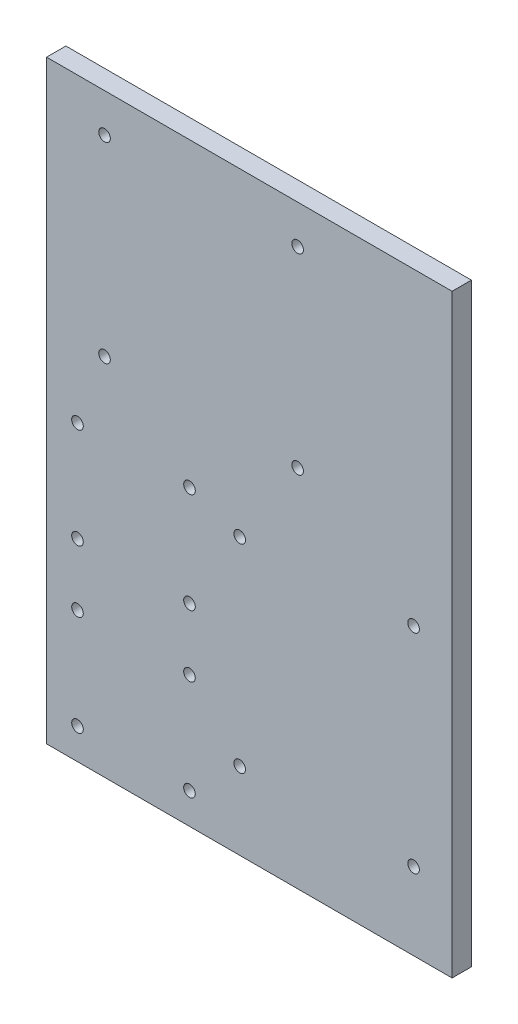
ISO-10303-21;
HEADER;
FILE_DESCRIPTION(('STEP AP214'),'2;1');
FILE_NAME('part.step','',(''),(''),'','','');
FILE_SCHEMA(('AUTOMOTIVE_DESIGN { 1 0 10303 214 1 1 1 1 }'));
ENDSEC;
DATA;
#1=APPLICATION_CONTEXT('core data for automotive mechanical design processes');
#2=APPLICATION_PROTOCOL_DEFINITION('international standard','automotive_design',2000,#1);
#3=PRODUCT_CONTEXT('',#1,'mechanical');
#4=PRODUCT('Part','Part','',(#3));
#5=PRODUCT_RELATED_PRODUCT_CATEGORY('part','',(#4));
#6=PRODUCT_DEFINITION_FORMATION('','',#4);
#7=PRODUCT_DEFINITION_CONTEXT('part definition',#1,'design');
#8=PRODUCT_DEFINITION('design','',#6,#7);
#9=PRODUCT_DEFINITION_SHAPE('','',#8);
#10=(LENGTH_UNIT() NAMED_UNIT(*) SI_UNIT(.MILLI.,.METRE.));
#11=(NAMED_UNIT(*) PLANE_ANGLE_UNIT() SI_UNIT($,.RADIAN.));
#12=(NAMED_UNIT(*) SI_UNIT($,.STERADIAN.) SOLID_ANGLE_UNIT());
#13=UNCERTAINTY_MEASURE_WITH_UNIT(LENGTH_MEASURE(1.E-05),#10,'distance_accuracy_value','');
#14=(GEOMETRIC_REPRESENTATION_CONTEXT(3) GLOBAL_UNCERTAINTY_ASSIGNED_CONTEXT((#13)) GLOBAL_UNIT_ASSIGNED_CONTEXT((#10,
#11,#12)) REPRESENTATION_CONTEXT('',''));
#15=CARTESIAN_POINT('',(0.,0.,0.));
#16=DIRECTION('',(0.,0.,1.));
#17=DIRECTION('',(1.,0.,0.));
#18=AXIS2_PLACEMENT_3D('',#15,#16,#17);
#19=CARTESIAN_POINT('',(-40.,-119.,5.));
#20=DIRECTION('',(0.,1.,0.));
#21=DIRECTION('',(0.,0.,1.));
#22=AXIS2_PLACEMENT_3D('',#19,#20,#21);
#23=PLANE('',#22);
#24=DIRECTION('',(1.,0.,0.));
#25=VECTOR('',#24,1.);
#26=CARTESIAN_POINT('',(-40.,-119.,0.));
#27=LINE('',#26,#25);
#28=CARTESIAN_POINT('',(-40.,-119.,0.));
#29=VERTEX_POINT('',#28);
#30=CARTESIAN_POINT('',(65.,-119.,0.));
#31=VERTEX_POINT('',#30);
#32=EDGE_CURVE('E99',#29,#31,#27,.T.);
#33=ORIENTED_EDGE('',*,*,#32,.T.);
#34=DIRECTION('',(0.,0.,-1.));
#35=VECTOR('',#34,1.);
#36=CARTESIAN_POINT('',(65.,-119.,5.));
#37=LINE('',#36,#35);
#38=CARTESIAN_POINT('',(65.,-119.,5.));
#39=VERTEX_POINT('',#38);
#40=EDGE_CURVE('E11',#39,#31,#37,.T.);
#41=ORIENTED_EDGE('',*,*,#40,.F.);
#42=DIRECTION('',(1.,0.,0.));
#43=VECTOR('',#42,1.);
#44=CARTESIAN_POINT('',(-40.,-119.,5.));
#45=LINE('',#44,#43);
#46=CARTESIAN_POINT('',(-40.,-119.,5.));
#47=VERTEX_POINT('',#46);
#48=EDGE_CURVE('E76',#47,#39,#45,.T.);
#49=ORIENTED_EDGE('',*,*,#48,.F.);
#50=DIRECTION('',(0.,0.,-1.));
#51=VECTOR('',#50,1.);
#52=CARTESIAN_POINT('',(-40.,-119.,5.));
#53=LINE('',#52,#51);
#54=EDGE_CURVE('E95',#47,#29,#53,.T.);
#55=ORIENTED_EDGE('',*,*,#54,.T.);
#56=EDGE_LOOP('',(#33,#41,#49,#55));
#57=FACE_BOUND('',#56,.T.);
#58=ADVANCED_FACE('F37',(#57),#23,.F.);
#59=CARTESIAN_POINT('',(65.,35.,5.));
#60=DIRECTION('',(1.,0.,0.));
#61=DIRECTION('',(0.,0.,-1.));
#62=AXIS2_PLACEMENT_3D('',#59,#60,#61);
#63=PLANE('',#62);
#64=DIRECTION('',(0.,-1.,0.));
#65=VECTOR('',#64,1.);
#66=CARTESIAN_POINT('',(65.,35.,0.));
#67=LINE('',#66,#65);
#68=CARTESIAN_POINT('',(65.,35.,0.));
#69=VERTEX_POINT('',#68);
#70=EDGE_CURVE('E85',#69,#31,#67,.T.);
#71=ORIENTED_EDGE('',*,*,#70,.F.);
#72=DIRECTION('',(0.,0.,-1.));
#73=VECTOR('',#72,1.);
#74=CARTESIAN_POINT('',(65.,35.,5.));
#75=LINE('',#74,#73);
#76=CARTESIAN_POINT('',(65.,35.,5.));
#77=VERTEX_POINT('',#76);
#78=EDGE_CURVE('E45',#77,#69,#75,.T.);
#79=ORIENTED_EDGE('',*,*,#78,.F.);
#80=DIRECTION('',(0.,-1.,0.));
#81=VECTOR('',#80,1.);
#82=CARTESIAN_POINT('',(65.,35.,5.));
#83=LINE('',#82,#81);
#84=EDGE_CURVE('E83',#77,#39,#83,.T.);
#85=ORIENTED_EDGE('',*,*,#84,.T.);
#86=ORIENTED_EDGE('',*,*,#40,.T.);
#87=EDGE_LOOP('',(#71,#79,#85,#86));
#88=FACE_BOUND('',#87,.T.);
#89=ADVANCED_FACE('F82',(#88),#63,.T.);
#90=CARTESIAN_POINT('',(-40.,35.,5.));
#91=DIRECTION('',(0.,1.,0.));
#92=DIRECTION('',(0.,0.,1.));
#93=AXIS2_PLACEMENT_3D('',#90,#91,#92);
#94=PLANE('',#93);
#95=DIRECTION('',(1.,0.,0.));
#96=VECTOR('',#95,1.);
#97=CARTESIAN_POINT('',(-40.,35.,0.));
#98=LINE('',#97,#96);
#99=CARTESIAN_POINT('',(-40.,35.,0.));
#100=VERTEX_POINT('',#99);
#101=EDGE_CURVE('E104',#100,#69,#98,.T.);
#102=ORIENTED_EDGE('',*,*,#101,.F.);
#103=DIRECTION('',(0.,0.,-1.));
#104=VECTOR('',#103,1.);
#105=CARTESIAN_POINT('',(-40.,35.,5.));
#106=LINE('',#105,#104);
#107=CARTESIAN_POINT('',(-40.,35.,5.));
#108=VERTEX_POINT('',#107);
#109=EDGE_CURVE('E68',#108,#100,#106,.T.);
#110=ORIENTED_EDGE('',*,*,#109,.F.);
#111=DIRECTION('',(1.,0.,0.));
#112=VECTOR('',#111,1.);
#113=CARTESIAN_POINT('',(-40.,35.,5.));
#114=LINE('',#113,#112);
#115=EDGE_CURVE('E91',#108,#77,#114,.T.);
#116=ORIENTED_EDGE('',*,*,#115,.T.);
#117=ORIENTED_EDGE('',*,*,#78,.T.);
#118=EDGE_LOOP('',(#102,#110,#116,#117));
#119=FACE_BOUND('',#118,.T.);
#120=ADVANCED_FACE('F93',(#119),#94,.T.);
#121=CARTESIAN_POINT('',(-40.,35.,5.));
#122=DIRECTION('',(1.,0.,0.));
#123=DIRECTION('',(0.,1.,0.));
#124=AXIS2_PLACEMENT_3D('',#121,#122,#123);
#125=PLANE('',#124);
#126=DIRECTION('',(0.,-1.,0.));
#127=VECTOR('',#126,1.);
#128=CARTESIAN_POINT('',(-40.,35.,0.));
#129=LINE('',#128,#127);
#130=EDGE_CURVE('E71',#100,#29,#129,.T.);
#131=ORIENTED_EDGE('',*,*,#130,.T.);
#132=ORIENTED_EDGE('',*,*,#54,.F.);
#133=DIRECTION('',(0.,-1.,0.));
#134=VECTOR('',#133,1.);
#135=CARTESIAN_POINT('',(-40.,35.,5.));
#136=LINE('',#135,#134);
#137=EDGE_CURVE('E53',#108,#47,#136,.T.);
#138=ORIENTED_EDGE('',*,*,#137,.F.);
#139=ORIENTED_EDGE('',*,*,#109,.T.);
#140=EDGE_LOOP('',(#131,#132,#138,#139));
#141=FACE_BOUND('',#140,.T.);
#142=ADVANCED_FACE('F123',(#141),#125,.F.);
#143=CARTESIAN_POINT('',(0.,0.,5.));
#144=DIRECTION('',(0.,0.,-1.));
#145=DIRECTION('',(-1.,0.,0.));
#146=AXIS2_PLACEMENT_3D('',#143,#144,#145);
#147=PLANE('',#146);
#148=CARTESIAN_POINT('',(9.99999999999999,-47.56,5.));
#149=DIRECTION('',(0.,0.,-1.));
#150=DIRECTION('',(-1.,0.,0.));
#151=AXIS2_PLACEMENT_3D('',#148,#149,#150);
#152=CIRCLE('',#151,1.5);
#153=CARTESIAN_POINT('',(8.49999999999999,-47.56,5.));
#154=VERTEX_POINT('',#153);
#155=EDGE_CURVE('E349',#154,#154,#152,.T.);
#156=ORIENTED_EDGE('',*,*,#155,.T.);
#157=EDGE_LOOP('',(#156));
#158=FACE_BOUND('',#157,.T.);
#159=CARTESIAN_POINT('',(9.99999999999999,-99.,5.));
#160=DIRECTION('',(0.,0.,-1.));
#161=DIRECTION('',(-1.,0.,0.));
#162=AXIS2_PLACEMENT_3D('',#159,#160,#161);
#163=CIRCLE('',#162,1.5);
#164=CARTESIAN_POINT('',(8.49999999999998,-99.,5.));
#165=VERTEX_POINT('',#164);
#166=EDGE_CURVE('E355',#165,#165,#163,.T.);
#167=ORIENTED_EDGE('',*,*,#166,.T.);
#168=EDGE_LOOP('',(#167));
#169=FACE_BOUND('',#168,.T.);
#170=CARTESIAN_POINT('',(55.0184017930446,-99.,5.));
#171=DIRECTION('',(0.,0.,-1.));
#172=DIRECTION('',(-1.,0.,0.));
#173=AXIS2_PLACEMENT_3D('',#170,#171,#172);
#174=CIRCLE('',#173,1.5);
#175=CARTESIAN_POINT('',(53.5184017930446,-99.,5.));
#176=VERTEX_POINT('',#175);
#177=EDGE_CURVE('E343',#176,#176,#174,.T.);
#178=ORIENTED_EDGE('',*,*,#177,.T.);
#179=EDGE_LOOP('',(#178));
#180=FACE_BOUND('',#179,.T.);
#181=CARTESIAN_POINT('',(55.0184017930446,-45.02,5.));
#182=DIRECTION('',(0.,0.,-1.));
#183=DIRECTION('',(-1.,0.,0.));
#184=AXIS2_PLACEMENT_3D('',#181,#182,#183);
#185=CIRCLE('',#184,1.5);
#186=CARTESIAN_POINT('',(53.5184017930446,-45.02,5.));
#187=VERTEX_POINT('',#186);
#188=EDGE_CURVE('E326',#187,#187,#185,.T.);
#189=ORIENTED_EDGE('',*,*,#188,.T.);
#190=EDGE_LOOP('',(#189));
#191=FACE_BOUND('',#190,.T.);
#192=CARTESIAN_POINT('',(25.,-24.6066772895717,5.));
#193=DIRECTION('',(0.,0.,-1.));
#194=DIRECTION('',(-1.,0.,0.));
#195=AXIS2_PLACEMENT_3D('',#192,#193,#194);
#196=CIRCLE('',#195,1.5);
#197=CARTESIAN_POINT('',(23.5,-24.6066772895717,5.));
#198=VERTEX_POINT('',#197);
#199=EDGE_CURVE('E325',#198,#198,#196,.T.);
#200=ORIENTED_EDGE('',*,*,#199,.T.);
#201=EDGE_LOOP('',(#200));
#202=FACE_BOUND('',#201,.T.);
#203=CARTESIAN_POINT('',(-25.,-24.6066772895717,5.));
#204=DIRECTION('',(0.,0.,-1.));
#205=DIRECTION('',(-1.,0.,0.));
#206=AXIS2_PLACEMENT_3D('',#203,#204,#205);
#207=CIRCLE('',#206,1.5);
#208=CARTESIAN_POINT('',(-26.5,-24.6066772895717,5.));
#209=VERTEX_POINT('',#208);
#210=EDGE_CURVE('E332',#209,#209,#207,.T.);
#211=ORIENTED_EDGE('',*,*,#210,.T.);
#212=EDGE_LOOP('',(#211));
#213=FACE_BOUND('',#212,.T.);
#214=CARTESIAN_POINT('',(-25.,25.,5.));
#215=DIRECTION('',(0.,0.,-1.));
#216=DIRECTION('',(-1.,0.,0.));
#217=AXIS2_PLACEMENT_3D('',#214,#215,#216);
#218=CIRCLE('',#217,1.5);
#219=CARTESIAN_POINT('',(-26.5,25.,5.));
#220=VERTEX_POINT('',#219);
#221=EDGE_CURVE('E319',#220,#220,#218,.T.);
#222=ORIENTED_EDGE('',*,*,#221,.T.);
#223=EDGE_LOOP('',(#222));
#224=FACE_BOUND('',#223,.T.);
#225=CARTESIAN_POINT('',(25.,25.,5.));
#226=DIRECTION('',(0.,0.,-1.));
#227=DIRECTION('',(-1.,0.,0.));
#228=AXIS2_PLACEMENT_3D('',#225,#226,#227);
#229=CIRCLE('',#228,1.5);
#230=CARTESIAN_POINT('',(23.5,25.,5.));
#231=VERTEX_POINT('',#230);
#232=EDGE_CURVE('E311',#231,#231,#229,.T.);
#233=ORIENTED_EDGE('',*,*,#232,.T.);
#234=EDGE_LOOP('',(#233));
#235=FACE_BOUND('',#234,.T.);
#236=CARTESIAN_POINT('',(-3.00000000000002,-43.,5.));
#237=DIRECTION('',(0.,0.,-1.));
#238=DIRECTION('',(-1.,0.,0.));
#239=AXIS2_PLACEMENT_3D('',#236,#237,#238);
#240=CIRCLE('',#239,1.5);
#241=CARTESIAN_POINT('',(-4.50000000000002,-43.,5.));
#242=VERTEX_POINT('',#241);
#243=EDGE_CURVE('E102',#242,#242,#240,.T.);
#244=ORIENTED_EDGE('',*,*,#243,.T.);
#245=EDGE_LOOP('',(#244));
#246=FACE_BOUND('',#245,.T.);
#247=CARTESIAN_POINT('',(-3.00000000000002,-69.,5.));
#248=DIRECTION('',(0.,0.,-1.));
#249=DIRECTION('',(-1.,0.,0.));
#250=AXIS2_PLACEMENT_3D('',#247,#248,#249);
#251=CIRCLE('',#250,1.5);
#252=CARTESIAN_POINT('',(-4.50000000000002,-69.,5.));
#253=VERTEX_POINT('',#252);
#254=EDGE_CURVE('E259',#253,#253,#251,.T.);
#255=ORIENTED_EDGE('',*,*,#254,.T.);
#256=EDGE_LOOP('',(#255));
#257=FACE_BOUND('',#256,.T.);
#258=CARTESIAN_POINT('',(-32.,-85.,5.));
#259=DIRECTION('',(0.,0.,-1.));
#260=DIRECTION('',(-1.,0.,0.));
#261=AXIS2_PLACEMENT_3D('',#258,#259,#260);
#262=CIRCLE('',#261,1.5);
#263=CARTESIAN_POINT('',(-33.5,-85.,5.));
#264=VERTEX_POINT('',#263);
#265=EDGE_CURVE('E255',#264,#264,#262,.T.);
#266=ORIENTED_EDGE('',*,*,#265,.T.);
#267=EDGE_LOOP('',(#266));
#268=FACE_BOUND('',#267,.T.);
#269=CARTESIAN_POINT('',(-32.,-111.,5.));
#270=DIRECTION('',(0.,0.,-1.));
#271=DIRECTION('',(-1.,0.,0.));
#272=AXIS2_PLACEMENT_3D('',#269,#270,#271);
#273=CIRCLE('',#272,1.5);
#274=CARTESIAN_POINT('',(-33.5,-111.,5.));
#275=VERTEX_POINT('',#274);
#276=EDGE_CURVE('E253',#275,#275,#273,.T.);
#277=ORIENTED_EDGE('',*,*,#276,.T.);
#278=EDGE_LOOP('',(#277));
#279=FACE_BOUND('',#278,.T.);
#280=CARTESIAN_POINT('',(-3.00000000000005,-111.,5.));
#281=DIRECTION('',(0.,0.,-1.));
#282=DIRECTION('',(-1.,0.,0.));
#283=AXIS2_PLACEMENT_3D('',#280,#281,#282);
#284=CIRCLE('',#283,1.5);
#285=CARTESIAN_POINT('',(-4.50000000000005,-111.,5.));
#286=VERTEX_POINT('',#285);
#287=EDGE_CURVE('E256',#286,#286,#284,.T.);
#288=ORIENTED_EDGE('',*,*,#287,.T.);
#289=EDGE_LOOP('',(#288));
#290=FACE_BOUND('',#289,.T.);
#291=CARTESIAN_POINT('',(-3.00000000000005,-85.,5.));
#292=DIRECTION('',(0.,0.,-1.));
#293=DIRECTION('',(-1.,0.,0.));
#294=AXIS2_PLACEMENT_3D('',#291,#292,#293);
#295=CIRCLE('',#294,1.5);
#296=CARTESIAN_POINT('',(-4.50000000000005,-85.,5.));
#297=VERTEX_POINT('',#296);
#298=EDGE_CURVE('E262',#297,#297,#295,.T.);
#299=ORIENTED_EDGE('',*,*,#298,.T.);
#300=EDGE_LOOP('',(#299));
#301=FACE_BOUND('',#300,.T.);
#302=CARTESIAN_POINT('',(-32.,-69.,5.));
#303=DIRECTION('',(0.,0.,-1.));
#304=DIRECTION('',(-1.,0.,0.));
#305=AXIS2_PLACEMENT_3D('',#302,#303,#304);
#306=CIRCLE('',#305,1.5);
#307=CARTESIAN_POINT('',(-33.5,-69.,5.));
#308=VERTEX_POINT('',#307);
#309=EDGE_CURVE('E285',#308,#308,#306,.T.);
#310=ORIENTED_EDGE('',*,*,#309,.T.);
#311=EDGE_LOOP('',(#310));
#312=FACE_BOUND('',#311,.T.);
#313=CARTESIAN_POINT('',(-32.,-43.,5.));
#314=DIRECTION('',(0.,0.,-1.));
#315=DIRECTION('',(-1.,0.,0.));
#316=AXIS2_PLACEMENT_3D('',#313,#314,#315);
#317=CIRCLE('',#316,1.5);
#318=CARTESIAN_POINT('',(-33.5,-43.,5.));
#319=VERTEX_POINT('',#318);
#320=EDGE_CURVE('E288',#319,#319,#317,.T.);
#321=ORIENTED_EDGE('',*,*,#320,.T.);
#322=EDGE_LOOP('',(#321));
#323=FACE_BOUND('',#322,.T.);
#324=ORIENTED_EDGE('',*,*,#48,.T.);
#325=ORIENTED_EDGE('',*,*,#84,.F.);
#326=ORIENTED_EDGE('',*,*,#115,.F.);
#327=ORIENTED_EDGE('',*,*,#137,.T.);
#328=EDGE_LOOP('',(#324,#325,#326,#327));
#329=FACE_BOUND('',#328,.T.);
#330=ADVANCED_FACE('F90',(#158,#169,#180,#191,#202,#213,#224,#235,#246,#257,#268,#279,#290,#301,
#312,#323,#329),#147,.F.);
#331=CARTESIAN_POINT('',(0.,0.,0.));
#332=DIRECTION('',(0.,0.,-1.));
#333=DIRECTION('',(-1.,0.,0.));
#334=AXIS2_PLACEMENT_3D('',#331,#332,#333);
#335=PLANE('',#334);
#336=CARTESIAN_POINT('',(9.99999999999999,-47.56,0.));
#337=DIRECTION('',(0.,0.,-1.));
#338=DIRECTION('',(-1.,0.,0.));
#339=AXIS2_PLACEMENT_3D('',#336,#337,#338);
#340=CIRCLE('',#339,1.5);
#341=CARTESIAN_POINT('',(8.49999999999999,-47.56,0.));
#342=VERTEX_POINT('',#341);
#343=EDGE_CURVE('E346',#342,#342,#340,.T.);
#344=ORIENTED_EDGE('',*,*,#343,.F.);
#345=EDGE_LOOP('',(#344));
#346=FACE_BOUND('',#345,.T.);
#347=CARTESIAN_POINT('',(9.99999999999999,-99.,0.));
#348=DIRECTION('',(0.,0.,-1.));
#349=DIRECTION('',(-1.,0.,0.));
#350=AXIS2_PLACEMENT_3D('',#347,#348,#349);
#351=CIRCLE('',#350,1.5);
#352=CARTESIAN_POINT('',(8.49999999999998,-99.,0.));
#353=VERTEX_POINT('',#352);
#354=EDGE_CURVE('E352',#353,#353,#351,.T.);
#355=ORIENTED_EDGE('',*,*,#354,.F.);
#356=EDGE_LOOP('',(#355));
#357=FACE_BOUND('',#356,.T.);
#358=CARTESIAN_POINT('',(55.0184017930446,-99.,0.));
#359=DIRECTION('',(0.,0.,-1.));
#360=DIRECTION('',(-1.,0.,0.));
#361=AXIS2_PLACEMENT_3D('',#358,#359,#360);
#362=CIRCLE('',#361,1.5);
#363=CARTESIAN_POINT('',(53.5184017930446,-99.,0.));
#364=VERTEX_POINT('',#363);
#365=EDGE_CURVE('E358',#364,#364,#362,.T.);
#366=ORIENTED_EDGE('',*,*,#365,.F.);
#367=EDGE_LOOP('',(#366));
#368=FACE_BOUND('',#367,.T.);
#369=CARTESIAN_POINT('',(55.0184017930446,-45.02,0.));
#370=DIRECTION('',(0.,0.,-1.));
#371=DIRECTION('',(-1.,0.,0.));
#372=AXIS2_PLACEMENT_3D('',#369,#370,#371);
#373=CIRCLE('',#372,1.5);
#374=CARTESIAN_POINT('',(53.5184017930446,-45.02,0.));
#375=VERTEX_POINT('',#374);
#376=EDGE_CURVE('E340',#375,#375,#373,.T.);
#377=ORIENTED_EDGE('',*,*,#376,.F.);
#378=EDGE_LOOP('',(#377));
#379=FACE_BOUND('',#378,.T.);
#380=CARTESIAN_POINT('',(25.,-24.6066772895717,0.));
#381=DIRECTION('',(0.,0.,-1.));
#382=DIRECTION('',(-1.,0.,0.));
#383=AXIS2_PLACEMENT_3D('',#380,#381,#382);
#384=CIRCLE('',#383,1.5);
#385=CARTESIAN_POINT('',(23.5,-24.6066772895717,0.));
#386=VERTEX_POINT('',#385);
#387=EDGE_CURVE('E322',#386,#386,#384,.T.);
#388=ORIENTED_EDGE('',*,*,#387,.F.);
#389=EDGE_LOOP('',(#388));
#390=FACE_BOUND('',#389,.T.);
#391=CARTESIAN_POINT('',(-25.,-24.6066772895717,0.));
#392=DIRECTION('',(0.,0.,-1.));
#393=DIRECTION('',(-1.,0.,0.));
#394=AXIS2_PLACEMENT_3D('',#391,#392,#393);
#395=CIRCLE('',#394,1.5);
#396=CARTESIAN_POINT('',(-26.5,-24.6066772895717,0.));
#397=VERTEX_POINT('',#396);
#398=EDGE_CURVE('E329',#397,#397,#395,.T.);
#399=ORIENTED_EDGE('',*,*,#398,.F.);
#400=EDGE_LOOP('',(#399));
#401=FACE_BOUND('',#400,.T.);
#402=CARTESIAN_POINT('',(-25.,25.,0.));
#403=DIRECTION('',(0.,0.,-1.));
#404=DIRECTION('',(-1.,0.,0.));
#405=AXIS2_PLACEMENT_3D('',#402,#403,#404);
#406=CIRCLE('',#405,1.5);
#407=CARTESIAN_POINT('',(-26.5,25.,0.));
#408=VERTEX_POINT('',#407);
#409=EDGE_CURVE('E335',#408,#408,#406,.T.);
#410=ORIENTED_EDGE('',*,*,#409,.F.);
#411=EDGE_LOOP('',(#410));
#412=FACE_BOUND('',#411,.T.);
#413=CARTESIAN_POINT('',(25.,25.,0.));
#414=DIRECTION('',(0.,0.,-1.));
#415=DIRECTION('',(-1.,0.,0.));
#416=AXIS2_PLACEMENT_3D('',#413,#414,#415);
#417=CIRCLE('',#416,1.5);
#418=CARTESIAN_POINT('',(23.5,25.,0.));
#419=VERTEX_POINT('',#418);
#420=EDGE_CURVE('E316',#419,#419,#417,.T.);
#421=ORIENTED_EDGE('',*,*,#420,.F.);
#422=EDGE_LOOP('',(#421));
#423=FACE_BOUND('',#422,.T.);
#424=CARTESIAN_POINT('',(-3.00000000000002,-43.,0.));
#425=DIRECTION('',(0.,0.,-1.));
#426=DIRECTION('',(-1.,0.,0.));
#427=AXIS2_PLACEMENT_3D('',#424,#425,#426);
#428=CIRCLE('',#427,1.5);
#429=CARTESIAN_POINT('',(-4.50000000000002,-43.,0.));
#430=VERTEX_POINT('',#429);
#431=EDGE_CURVE('E294',#430,#430,#428,.T.);
#432=ORIENTED_EDGE('',*,*,#431,.F.);
#433=EDGE_LOOP('',(#432));
#434=FACE_BOUND('',#433,.T.);
#435=CARTESIAN_POINT('',(-3.00000000000002,-69.,0.));
#436=DIRECTION('',(0.,0.,-1.));
#437=DIRECTION('',(-1.,0.,0.));
#438=AXIS2_PLACEMENT_3D('',#435,#436,#437);
#439=CIRCLE('',#438,1.5);
#440=CARTESIAN_POINT('',(-4.50000000000002,-69.,0.));
#441=VERTEX_POINT('',#440);
#442=EDGE_CURVE('E302',#441,#441,#439,.T.);
#443=ORIENTED_EDGE('',*,*,#442,.F.);
#444=EDGE_LOOP('',(#443));
#445=FACE_BOUND('',#444,.T.);
#446=CARTESIAN_POINT('',(-32.,-85.,0.));
#447=DIRECTION('',(0.,0.,-1.));
#448=DIRECTION('',(-1.,0.,0.));
#449=AXIS2_PLACEMENT_3D('',#446,#447,#448);
#450=CIRCLE('',#449,1.5);
#451=CARTESIAN_POINT('',(-33.5,-85.,0.));
#452=VERTEX_POINT('',#451);
#453=EDGE_CURVE('E298',#452,#452,#450,.T.);
#454=ORIENTED_EDGE('',*,*,#453,.F.);
#455=EDGE_LOOP('',(#454));
#456=FACE_BOUND('',#455,.T.);
#457=CARTESIAN_POINT('',(-32.,-111.,0.));
#458=DIRECTION('',(0.,0.,-1.));
#459=DIRECTION('',(-1.,0.,0.));
#460=AXIS2_PLACEMENT_3D('',#457,#458,#459);
#461=CIRCLE('',#460,1.5);
#462=CARTESIAN_POINT('',(-33.5,-111.,0.));
#463=VERTEX_POINT('',#462);
#464=EDGE_CURVE('E250',#463,#463,#461,.T.);
#465=ORIENTED_EDGE('',*,*,#464,.F.);
#466=EDGE_LOOP('',(#465));
#467=FACE_BOUND('',#466,.T.);
#468=CARTESIAN_POINT('',(-3.00000000000005,-111.,0.));
#469=DIRECTION('',(0.,0.,-1.));
#470=DIRECTION('',(-1.,0.,0.));
#471=AXIS2_PLACEMENT_3D('',#468,#469,#470);
#472=CIRCLE('',#471,1.5);
#473=CARTESIAN_POINT('',(-4.50000000000005,-111.,0.));
#474=VERTEX_POINT('',#473);
#475=EDGE_CURVE('E299',#474,#474,#472,.T.);
#476=ORIENTED_EDGE('',*,*,#475,.F.);
#477=EDGE_LOOP('',(#476));
#478=FACE_BOUND('',#477,.T.);
#479=CARTESIAN_POINT('',(-3.00000000000005,-85.,0.));
#480=DIRECTION('',(0.,0.,-1.));
#481=DIRECTION('',(-1.,0.,0.));
#482=AXIS2_PLACEMENT_3D('',#479,#480,#481);
#483=CIRCLE('',#482,1.5);
#484=CARTESIAN_POINT('',(-4.50000000000005,-85.,0.));
#485=VERTEX_POINT('',#484);
#486=EDGE_CURVE('E310',#485,#485,#483,.T.);
#487=ORIENTED_EDGE('',*,*,#486,.F.);
#488=EDGE_LOOP('',(#487));
#489=FACE_BOUND('',#488,.T.);
#490=CARTESIAN_POINT('',(-32.,-69.,0.));
#491=DIRECTION('',(0.,0.,-1.));
#492=DIRECTION('',(-1.,0.,0.));
#493=AXIS2_PLACEMENT_3D('',#490,#491,#492);
#494=CIRCLE('',#493,1.5);
#495=CARTESIAN_POINT('',(-33.5,-69.,0.));
#496=VERTEX_POINT('',#495);
#497=EDGE_CURVE('E307',#496,#496,#494,.T.);
#498=ORIENTED_EDGE('',*,*,#497,.F.);
#499=EDGE_LOOP('',(#498));
#500=FACE_BOUND('',#499,.T.);
#501=CARTESIAN_POINT('',(-32.,-43.,0.));
#502=DIRECTION('',(0.,0.,-1.));
#503=DIRECTION('',(-1.,0.,0.));
#504=AXIS2_PLACEMENT_3D('',#501,#502,#503);
#505=CIRCLE('',#504,1.5);
#506=CARTESIAN_POINT('',(-33.5,-43.,0.));
#507=VERTEX_POINT('',#506);
#508=EDGE_CURVE('E290',#507,#507,#505,.T.);
#509=ORIENTED_EDGE('',*,*,#508,.F.);
#510=EDGE_LOOP('',(#509));
#511=FACE_BOUND('',#510,.T.);
#512=ORIENTED_EDGE('',*,*,#32,.F.);
#513=ORIENTED_EDGE('',*,*,#130,.F.);
#514=ORIENTED_EDGE('',*,*,#101,.T.);
#515=ORIENTED_EDGE('',*,*,#70,.T.);
#516=EDGE_LOOP('',(#512,#513,#514,#515));
#517=FACE_BOUND('',#516,.T.);
#518=ADVANCED_FACE('F111',(#346,#357,#368,#379,#390,#401,#412,#423,#434,#445,#456,#467,#478,
#489,#500,#511,#517),#335,.T.);
#519=CARTESIAN_POINT('',(-32.,-43.,10.));
#520=DIRECTION('',(0.,0.,-1.));
#521=DIRECTION('',(-1.,0.,0.));
#522=AXIS2_PLACEMENT_3D('',#519,#520,#521);
#523=CYLINDRICAL_SURFACE('',#522,1.5);
#524=ORIENTED_EDGE('',*,*,#508,.T.);
#525=EDGE_LOOP('',(#524));
#526=FACE_BOUND('',#525,.T.);
#527=ORIENTED_EDGE('',*,*,#320,.F.);
#528=EDGE_LOOP('',(#527));
#529=FACE_BOUND('',#528,.T.);
#530=ADVANCED_FACE('F113',(#526,#529),#523,.F.);
#531=CARTESIAN_POINT('',(-32.,-69.,10.));
#532=DIRECTION('',(0.,0.,-1.));
#533=DIRECTION('',(-1.,0.,0.));
#534=AXIS2_PLACEMENT_3D('',#531,#532,#533);
#535=CYLINDRICAL_SURFACE('',#534,1.5);
#536=ORIENTED_EDGE('',*,*,#497,.T.);
#537=EDGE_LOOP('',(#536));
#538=FACE_BOUND('',#537,.T.);
#539=ORIENTED_EDGE('',*,*,#309,.F.);
#540=EDGE_LOOP('',(#539));
#541=FACE_BOUND('',#540,.T.);
#542=ADVANCED_FACE('F120',(#538,#541),#535,.F.);
#543=CARTESIAN_POINT('',(-3.00000000000005,-85.,10.));
#544=DIRECTION('',(0.,0.,-1.));
#545=DIRECTION('',(-1.,0.,0.));
#546=AXIS2_PLACEMENT_3D('',#543,#544,#545);
#547=CYLINDRICAL_SURFACE('',#546,1.5);
#548=ORIENTED_EDGE('',*,*,#486,.T.);
#549=EDGE_LOOP('',(#548));
#550=FACE_BOUND('',#549,.T.);
#551=ORIENTED_EDGE('',*,*,#298,.F.);
#552=EDGE_LOOP('',(#551));
#553=FACE_BOUND('',#552,.T.);
#554=ADVANCED_FACE('F224',(#550,#553),#547,.F.);
#555=CARTESIAN_POINT('',(-3.00000000000005,-111.,10.));
#556=DIRECTION('',(0.,0.,-1.));
#557=DIRECTION('',(-1.,0.,0.));
#558=AXIS2_PLACEMENT_3D('',#555,#556,#557);
#559=CYLINDRICAL_SURFACE('',#558,1.5);
#560=ORIENTED_EDGE('',*,*,#475,.T.);
#561=EDGE_LOOP('',(#560));
#562=FACE_BOUND('',#561,.T.);
#563=ORIENTED_EDGE('',*,*,#287,.F.);
#564=EDGE_LOOP('',(#563));
#565=FACE_BOUND('',#564,.T.);
#566=ADVANCED_FACE('F220',(#562,#565),#559,.F.);
#567=CARTESIAN_POINT('',(-32.,-111.,10.));
#568=DIRECTION('',(0.,0.,-1.));
#569=DIRECTION('',(-1.,0.,0.));
#570=AXIS2_PLACEMENT_3D('',#567,#568,#569);
#571=CYLINDRICAL_SURFACE('',#570,1.5);
#572=ORIENTED_EDGE('',*,*,#464,.T.);
#573=EDGE_LOOP('',(#572));
#574=FACE_BOUND('',#573,.T.);
#575=ORIENTED_EDGE('',*,*,#276,.F.);
#576=EDGE_LOOP('',(#575));
#577=FACE_BOUND('',#576,.T.);
#578=ADVANCED_FACE('F223',(#574,#577),#571,.F.);
#579=CARTESIAN_POINT('',(-32.,-85.,10.));
#580=DIRECTION('',(0.,0.,-1.));
#581=DIRECTION('',(-1.,0.,0.));
#582=AXIS2_PLACEMENT_3D('',#579,#580,#581);
#583=CYLINDRICAL_SURFACE('',#582,1.5);
#584=ORIENTED_EDGE('',*,*,#453,.T.);
#585=EDGE_LOOP('',(#584));
#586=FACE_BOUND('',#585,.T.);
#587=ORIENTED_EDGE('',*,*,#265,.F.);
#588=EDGE_LOOP('',(#587));
#589=FACE_BOUND('',#588,.T.);
#590=ADVANCED_FACE('F238',(#586,#589),#583,.F.);
#591=CARTESIAN_POINT('',(-3.00000000000002,-69.,10.));
#592=DIRECTION('',(0.,0.,-1.));
#593=DIRECTION('',(-1.,0.,0.));
#594=AXIS2_PLACEMENT_3D('',#591,#592,#593);
#595=CYLINDRICAL_SURFACE('',#594,1.5);
#596=ORIENTED_EDGE('',*,*,#442,.T.);
#597=EDGE_LOOP('',(#596));
#598=FACE_BOUND('',#597,.T.);
#599=ORIENTED_EDGE('',*,*,#254,.F.);
#600=EDGE_LOOP('',(#599));
#601=FACE_BOUND('',#600,.T.);
#602=ADVANCED_FACE('F234',(#598,#601),#595,.F.);
#603=CARTESIAN_POINT('',(-3.00000000000002,-43.,10.));
#604=DIRECTION('',(0.,0.,-1.));
#605=DIRECTION('',(-1.,0.,0.));
#606=AXIS2_PLACEMENT_3D('',#603,#604,#605);
#607=CYLINDRICAL_SURFACE('',#606,1.5);
#608=ORIENTED_EDGE('',*,*,#431,.T.);
#609=EDGE_LOOP('',(#608));
#610=FACE_BOUND('',#609,.T.);
#611=ORIENTED_EDGE('',*,*,#243,.F.);
#612=EDGE_LOOP('',(#611));
#613=FACE_BOUND('',#612,.T.);
#614=ADVANCED_FACE('F218',(#610,#613),#607,.F.);
#615=CARTESIAN_POINT('',(25.,25.,5.));
#616=DIRECTION('',(0.,0.,-1.));
#617=DIRECTION('',(-1.,0.,0.));
#618=AXIS2_PLACEMENT_3D('',#615,#616,#617);
#619=CYLINDRICAL_SURFACE('',#618,1.5);
#620=ORIENTED_EDGE('',*,*,#232,.F.);
#621=EDGE_LOOP('',(#620));
#622=FACE_BOUND('',#621,.T.);
#623=ORIENTED_EDGE('',*,*,#420,.T.);
#624=EDGE_LOOP('',(#623));
#625=FACE_BOUND('',#624,.T.);
#626=ADVANCED_FACE('F209',(#622,#625),#619,.F.);
#627=CARTESIAN_POINT('',(-25.,25.,5.));
#628=DIRECTION('',(0.,0.,-1.));
#629=DIRECTION('',(-1.,0.,0.));
#630=AXIS2_PLACEMENT_3D('',#627,#628,#629);
#631=CYLINDRICAL_SURFACE('',#630,1.5);
#632=ORIENTED_EDGE('',*,*,#221,.F.);
#633=EDGE_LOOP('',(#632));
#634=FACE_BOUND('',#633,.T.);
#635=ORIENTED_EDGE('',*,*,#409,.T.);
#636=EDGE_LOOP('',(#635));
#637=FACE_BOUND('',#636,.T.);
#638=ADVANCED_FACE('F205',(#634,#637),#631,.F.);
#639=CARTESIAN_POINT('',(-25.,-24.6066772895717,5.));
#640=DIRECTION('',(0.,0.,-1.));
#641=DIRECTION('',(-1.,0.,0.));
#642=AXIS2_PLACEMENT_3D('',#639,#640,#641);
#643=CYLINDRICAL_SURFACE('',#642,1.5);
#644=ORIENTED_EDGE('',*,*,#210,.F.);
#645=EDGE_LOOP('',(#644));
#646=FACE_BOUND('',#645,.T.);
#647=ORIENTED_EDGE('',*,*,#398,.T.);
#648=EDGE_LOOP('',(#647));
#649=FACE_BOUND('',#648,.T.);
#650=ADVANCED_FACE('F208',(#646,#649),#643,.F.);
#651=CARTESIAN_POINT('',(25.,-24.6066772895717,5.));
#652=DIRECTION('',(0.,0.,-1.));
#653=DIRECTION('',(-1.,0.,0.));
#654=AXIS2_PLACEMENT_3D('',#651,#652,#653);
#655=CYLINDRICAL_SURFACE('',#654,1.5);
#656=ORIENTED_EDGE('',*,*,#199,.F.);
#657=EDGE_LOOP('',(#656));
#658=FACE_BOUND('',#657,.T.);
#659=ORIENTED_EDGE('',*,*,#387,.T.);
#660=EDGE_LOOP('',(#659));
#661=FACE_BOUND('',#660,.T.);
#662=ADVANCED_FACE('F153',(#658,#661),#655,.F.);
#663=CARTESIAN_POINT('',(55.0184017930446,-45.02,5.));
#664=DIRECTION('',(0.,0.,-1.));
#665=DIRECTION('',(-1.,0.,0.));
#666=AXIS2_PLACEMENT_3D('',#663,#664,#665);
#667=CYLINDRICAL_SURFACE('',#666,1.5);
#668=ORIENTED_EDGE('',*,*,#188,.F.);
#669=EDGE_LOOP('',(#668));
#670=FACE_BOUND('',#669,.T.);
#671=ORIENTED_EDGE('',*,*,#376,.T.);
#672=EDGE_LOOP('',(#671));
#673=FACE_BOUND('',#672,.T.);
#674=ADVANCED_FACE('F163',(#670,#673),#667,.F.);
#675=CARTESIAN_POINT('',(55.0184017930446,-99.,5.));
#676=DIRECTION('',(0.,0.,-1.));
#677=DIRECTION('',(-1.,0.,0.));
#678=AXIS2_PLACEMENT_3D('',#675,#676,#677);
#679=CYLINDRICAL_SURFACE('',#678,1.5);
#680=ORIENTED_EDGE('',*,*,#177,.F.);
#681=EDGE_LOOP('',(#680));
#682=FACE_BOUND('',#681,.T.);
#683=ORIENTED_EDGE('',*,*,#365,.T.);
#684=EDGE_LOOP('',(#683));
#685=FACE_BOUND('',#684,.T.);
#686=ADVANCED_FACE('F168',(#682,#685),#679,.F.);
#687=CARTESIAN_POINT('',(9.99999999999999,-99.,5.));
#688=DIRECTION('',(0.,0.,-1.));
#689=DIRECTION('',(-1.,0.,0.));
#690=AXIS2_PLACEMENT_3D('',#687,#688,#689);
#691=CYLINDRICAL_SURFACE('',#690,1.5);
#692=ORIENTED_EDGE('',*,*,#166,.F.);
#693=EDGE_LOOP('',(#692));
#694=FACE_BOUND('',#693,.T.);
#695=ORIENTED_EDGE('',*,*,#354,.T.);
#696=EDGE_LOOP('',(#695));
#697=FACE_BOUND('',#696,.T.);
#698=ADVANCED_FACE('F178',(#694,#697),#691,.F.);
#699=CARTESIAN_POINT('',(9.99999999999999,-47.56,5.));
#700=DIRECTION('',(0.,0.,-1.));
#701=DIRECTION('',(-1.,0.,0.));
#702=AXIS2_PLACEMENT_3D('',#699,#700,#701);
#703=CYLINDRICAL_SURFACE('',#702,1.5);
#704=ORIENTED_EDGE('',*,*,#155,.F.);
#705=EDGE_LOOP('',(#704));
#706=FACE_BOUND('',#705,.T.);
#707=ORIENTED_EDGE('',*,*,#343,.T.);
#708=EDGE_LOOP('',(#707));
#709=FACE_BOUND('',#708,.T.);
#710=ADVANCED_FACE('F188',(#706,#709),#703,.F.);
#711=CLOSED_SHELL('',(#58,#89,#120,#142,#330,#518,#530,#542,#554,#566,#578,#590,#602,#614,#626,
#638,#650,#662,#674,#686,#698,#710));
#712=MANIFOLD_SOLID_BREP('B2',#711);
#713=ADVANCED_BREP_SHAPE_REPRESENTATION('',(#18,#712),#14);
#714=SHAPE_DEFINITION_REPRESENTATION(#9,#713);
ENDSEC;
END-ISO-10303-21;
